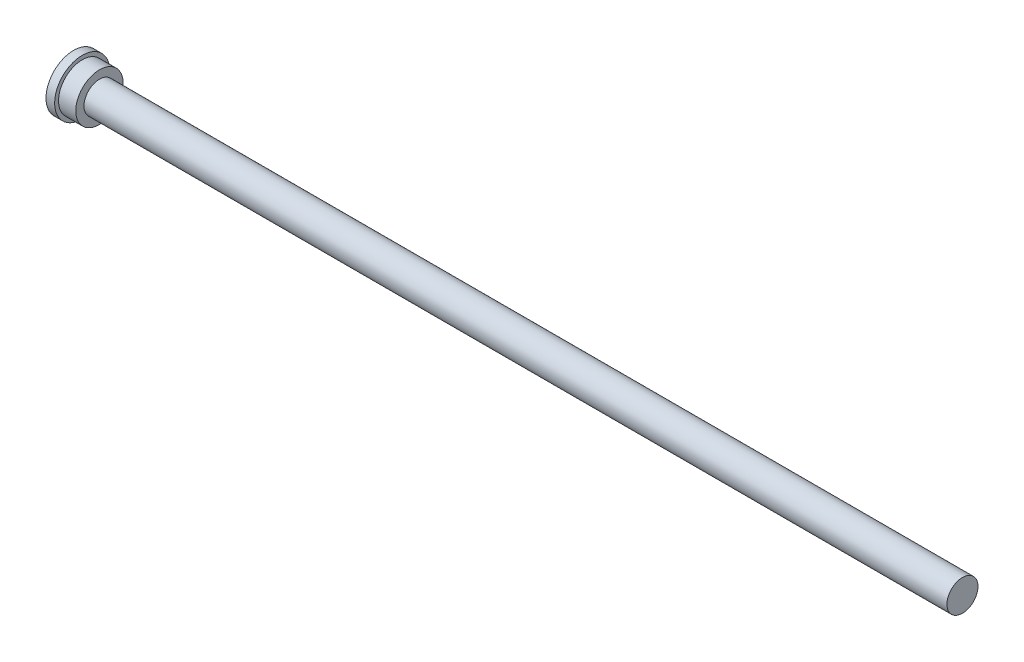
ISO-10303-21;
HEADER;
FILE_DESCRIPTION(('STEP AP214'),'2;1');
FILE_NAME('part.step','',(''),(''),'','','');
FILE_SCHEMA(('AUTOMOTIVE_DESIGN { 1 0 10303 214 1 1 1 1 }'));
ENDSEC;
DATA;
#1=APPLICATION_CONTEXT('core data for automotive mechanical design processes');
#2=APPLICATION_PROTOCOL_DEFINITION('international standard','automotive_design',2000,#1);
#3=PRODUCT_CONTEXT('',#1,'mechanical');
#4=PRODUCT('Part','Part','',(#3));
#5=PRODUCT_RELATED_PRODUCT_CATEGORY('part','',(#4));
#6=PRODUCT_DEFINITION_FORMATION('','',#4);
#7=PRODUCT_DEFINITION_CONTEXT('part definition',#1,'design');
#8=PRODUCT_DEFINITION('design','',#6,#7);
#9=PRODUCT_DEFINITION_SHAPE('','',#8);
#10=(LENGTH_UNIT() NAMED_UNIT(*) SI_UNIT(.MILLI.,.METRE.));
#11=(NAMED_UNIT(*) PLANE_ANGLE_UNIT() SI_UNIT($,.RADIAN.));
#12=(NAMED_UNIT(*) SI_UNIT($,.STERADIAN.) SOLID_ANGLE_UNIT());
#13=UNCERTAINTY_MEASURE_WITH_UNIT(LENGTH_MEASURE(1.E-05),#10,'distance_accuracy_value','');
#14=(GEOMETRIC_REPRESENTATION_CONTEXT(3) GLOBAL_UNCERTAINTY_ASSIGNED_CONTEXT((#13)) GLOBAL_UNIT_ASSIGNED_CONTEXT((#10,
#11,#12)) REPRESENTATION_CONTEXT('',''));
#15=CARTESIAN_POINT('',(0.,0.,0.));
#16=DIRECTION('',(0.,0.,1.));
#17=DIRECTION('',(1.,0.,0.));
#18=AXIS2_PLACEMENT_3D('',#15,#16,#17);
#19=CARTESIAN_POINT('',(25.4,0.,0.));
#20=DIRECTION('',(-1.,0.,0.));
#21=DIRECTION('',(0.,0.,1.));
#22=AXIS2_PLACEMENT_3D('',#19,#20,#21);
#23=CYLINDRICAL_SURFACE('',#22,34.925);
#24=CARTESIAN_POINT('',(25.4,0.,0.));
#25=DIRECTION('',(1.,0.,0.));
#26=DIRECTION('',(0.,0.,-1.));
#27=AXIS2_PLACEMENT_3D('',#24,#25,#26);
#28=CIRCLE('',#27,34.925);
#29=CARTESIAN_POINT('',(25.4,0.,-34.925));
#30=VERTEX_POINT('',#29);
#31=EDGE_CURVE('E38',#30,#30,#28,.T.);
#32=ORIENTED_EDGE('',*,*,#31,.F.);
#33=EDGE_LOOP('',(#32));
#34=FACE_BOUND('',#33,.T.);
#35=CARTESIAN_POINT('',(0.,0.,0.));
#36=DIRECTION('',(1.,0.,0.));
#37=DIRECTION('',(0.,0.,-1.));
#38=AXIS2_PLACEMENT_3D('',#35,#36,#37);
#39=CIRCLE('',#38,34.925);
#40=CARTESIAN_POINT('',(0.,0.,-34.925));
#41=VERTEX_POINT('',#40);
#42=EDGE_CURVE('E34',#41,#41,#39,.T.);
#43=ORIENTED_EDGE('',*,*,#42,.T.);
#44=EDGE_LOOP('',(#43));
#45=FACE_BOUND('',#44,.T.);
#46=ADVANCED_FACE('F31',(#34,#45),#23,.T.);
#47=CARTESIAN_POINT('',(25.4,0.,0.));
#48=DIRECTION('',(1.,0.,0.));
#49=DIRECTION('',(0.,0.,-1.));
#50=AXIS2_PLACEMENT_3D('',#47,#48,#49);
#51=PLANE('',#50);
#52=CARTESIAN_POINT('',(25.4,0.,0.));
#53=DIRECTION('',(1.,0.,0.));
#54=DIRECTION('',(0.,0.,-1.));
#55=AXIS2_PLACEMENT_3D('',#52,#53,#54);
#56=CIRCLE('',#55,22.86);
#57=CARTESIAN_POINT('',(25.4,0.,-22.86));
#58=VERTEX_POINT('',#57);
#59=EDGE_CURVE('E10',#58,#58,#56,.T.);
#60=ORIENTED_EDGE('',*,*,#59,.F.);
#61=EDGE_LOOP('',(#60));
#62=FACE_BOUND('',#61,.T.);
#63=ORIENTED_EDGE('',*,*,#31,.T.);
#64=EDGE_LOOP('',(#63));
#65=FACE_BOUND('',#64,.T.);
#66=ADVANCED_FACE('F79',(#62,#65),#51,.T.);
#67=CARTESIAN_POINT('',(1295.4,0.,0.));
#68=DIRECTION('',(-1.,0.,0.));
#69=DIRECTION('',(0.,0.,1.));
#70=AXIS2_PLACEMENT_3D('',#67,#68,#69);
#71=CYLINDRICAL_SURFACE('',#70,22.86);
#72=CARTESIAN_POINT('',(1295.4,0.,0.));
#73=DIRECTION('',(1.,0.,0.));
#74=DIRECTION('',(0.,0.,-1.));
#75=AXIS2_PLACEMENT_3D('',#72,#73,#74);
#76=CIRCLE('',#75,22.86);
#77=CARTESIAN_POINT('',(1295.4,0.,-22.86));
#78=VERTEX_POINT('',#77);
#79=EDGE_CURVE('E43',#78,#78,#76,.T.);
#80=ORIENTED_EDGE('',*,*,#79,.F.);
#81=EDGE_LOOP('',(#80));
#82=FACE_BOUND('',#81,.T.);
#83=ORIENTED_EDGE('',*,*,#59,.T.);
#84=EDGE_LOOP('',(#83));
#85=FACE_BOUND('',#84,.T.);
#86=ADVANCED_FACE('F75',(#82,#85),#71,.T.);
#87=CARTESIAN_POINT('',(1295.4,0.,0.));
#88=DIRECTION('',(1.,0.,0.));
#89=DIRECTION('',(0.,0.,-1.));
#90=AXIS2_PLACEMENT_3D('',#87,#88,#89);
#91=PLANE('',#90);
#92=ORIENTED_EDGE('',*,*,#79,.T.);
#93=EDGE_LOOP('',(#92));
#94=FACE_BOUND('',#93,.T.);
#95=ADVANCED_FACE('F67',(#94),#91,.T.);
#96=CARTESIAN_POINT('',(-12.7,0.,0.));
#97=DIRECTION('',(1.,0.,0.));
#98=DIRECTION('',(0.,0.,-1.));
#99=AXIS2_PLACEMENT_3D('',#96,#97,#98);
#100=CYLINDRICAL_SURFACE('',#99,40.64);
#101=CARTESIAN_POINT('',(-12.7,0.,0.));
#102=DIRECTION('',(-1.,0.,0.));
#103=DIRECTION('',(0.,0.,1.));
#104=AXIS2_PLACEMENT_3D('',#101,#102,#103);
#105=CIRCLE('',#104,40.64);
#106=CARTESIAN_POINT('',(-12.7,0.,40.64));
#107=VERTEX_POINT('',#106);
#108=EDGE_CURVE('E50',#107,#107,#105,.T.);
#109=ORIENTED_EDGE('',*,*,#108,.F.);
#110=EDGE_LOOP('',(#109));
#111=FACE_BOUND('',#110,.T.);
#112=CARTESIAN_POINT('',(0.,0.,0.));
#113=DIRECTION('',(-1.,0.,0.));
#114=DIRECTION('',(0.,0.,1.));
#115=AXIS2_PLACEMENT_3D('',#112,#113,#114);
#116=CIRCLE('',#115,40.64);
#117=CARTESIAN_POINT('',(0.,0.,40.64));
#118=VERTEX_POINT('',#117);
#119=EDGE_CURVE('E47',#118,#118,#116,.T.);
#120=ORIENTED_EDGE('',*,*,#119,.T.);
#121=EDGE_LOOP('',(#120));
#122=FACE_BOUND('',#121,.T.);
#123=ADVANCED_FACE('F65',(#111,#122),#100,.T.);
#124=CARTESIAN_POINT('',(-12.7,0.,0.));
#125=DIRECTION('',(-1.,0.,0.));
#126=DIRECTION('',(0.,0.,1.));
#127=AXIS2_PLACEMENT_3D('',#124,#125,#126);
#128=PLANE('',#127);
#129=ORIENTED_EDGE('',*,*,#108,.T.);
#130=EDGE_LOOP('',(#129));
#131=FACE_BOUND('',#130,.T.);
#132=ADVANCED_FACE('F61',(#131),#128,.T.);
#133=CARTESIAN_POINT('',(0.,0.,0.));
#134=DIRECTION('',(-1.,0.,0.));
#135=DIRECTION('',(0.,0.,1.));
#136=AXIS2_PLACEMENT_3D('',#133,#134,#135);
#137=PLANE('',#136);
#138=ORIENTED_EDGE('',*,*,#42,.F.);
#139=EDGE_LOOP('',(#138));
#140=FACE_BOUND('',#139,.T.);
#141=ORIENTED_EDGE('',*,*,#119,.F.);
#142=EDGE_LOOP('',(#141));
#143=FACE_BOUND('',#142,.T.);
#144=ADVANCED_FACE('F58',(#140,#143),#137,.F.);
#145=CLOSED_SHELL('',(#46,#66,#86,#95,#123,#132,#144));
#146=MANIFOLD_SOLID_BREP('B2',#145);
#147=ADVANCED_BREP_SHAPE_REPRESENTATION('',(#18,#146),#14);
#148=SHAPE_DEFINITION_REPRESENTATION(#9,#147);
ENDSEC;
END-ISO-10303-21;
